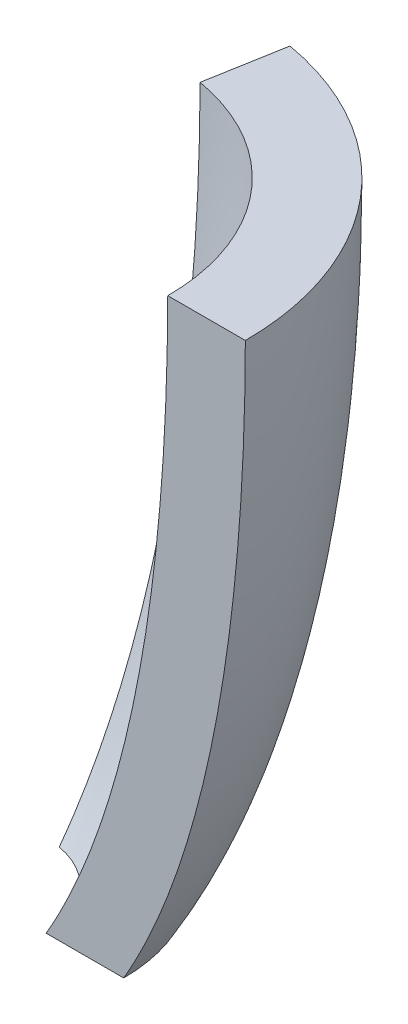
ISO-10303-21;
HEADER;
FILE_DESCRIPTION(('STEP AP214'),'2;1');
FILE_NAME('part.step','',(''),(''),'','','');
FILE_SCHEMA(('AUTOMOTIVE_DESIGN { 1 0 10303 214 1 1 1 1 }'));
ENDSEC;
DATA;
#1=APPLICATION_CONTEXT('core data for automotive mechanical design processes');
#2=APPLICATION_PROTOCOL_DEFINITION('international standard','automotive_design',2000,#1);
#3=PRODUCT_CONTEXT('',#1,'mechanical');
#4=PRODUCT('Part','Part','',(#3));
#5=PRODUCT_RELATED_PRODUCT_CATEGORY('part','',(#4));
#6=PRODUCT_DEFINITION_FORMATION('','',#4);
#7=PRODUCT_DEFINITION_CONTEXT('part definition',#1,'design');
#8=PRODUCT_DEFINITION('design','',#6,#7);
#9=PRODUCT_DEFINITION_SHAPE('','',#8);
#10=(LENGTH_UNIT() NAMED_UNIT(*) SI_UNIT(.MILLI.,.METRE.));
#11=(NAMED_UNIT(*) PLANE_ANGLE_UNIT() SI_UNIT($,.RADIAN.));
#12=(NAMED_UNIT(*) SI_UNIT($,.STERADIAN.) SOLID_ANGLE_UNIT());
#13=UNCERTAINTY_MEASURE_WITH_UNIT(LENGTH_MEASURE(1.E-05),#10,'distance_accuracy_value','');
#14=(GEOMETRIC_REPRESENTATION_CONTEXT(3) GLOBAL_UNCERTAINTY_ASSIGNED_CONTEXT((#13)) GLOBAL_UNIT_ASSIGNED_CONTEXT((#10,
#11,#12)) REPRESENTATION_CONTEXT('',''));
#15=CARTESIAN_POINT('',(0.,0.,0.));
#16=DIRECTION('',(0.,0.,1.));
#17=DIRECTION('',(1.,0.,0.));
#18=AXIS2_PLACEMENT_3D('',#15,#16,#17);
#19=CARTESIAN_POINT('',(6.30342884930946,0.,-35.7485214343432));
#20=CARTESIAN_POINT('',(6.29129475746775,-33.2959656166947,-35.6797055798836));
#21=CARTESIAN_POINT('',(5.40662829135171,-60.9232369629244,-30.6625127341742));
#22=CARTESIAN_POINT('',(3.5810063166775,-79.0124909027462,-20.3088960197096));
#23=B_SPLINE_CURVE_WITH_KNOTS('',3,(#19,#20,#21,#22),.UNSPECIFIED.,.F.,.F.,(4,4),(0.,1.),.UNSPECIFIED.);
#24=CARTESIAN_POINT('',(0.,0.,0.));
#25=DIRECTION('',(0.,-1.,0.));
#26=AXIS1_PLACEMENT('',#24,#25);
#27=SURFACE_OF_REVOLUTION('',#23,#26);
#28=CARTESIAN_POINT('',(0.,0.,0.));
#29=DIRECTION('',(0.,-1.,0.));
#30=DIRECTION('',(1.,0.,0.));
#31=AXIS2_PLACEMENT_3D('',#28,#29,#30);
#32=CIRCLE('',#31,36.3);
#33=CARTESIAN_POINT('',(6.30342884930946,0.,-35.7485214343432));
#34=VERTEX_POINT('',#33);
#35=CARTESIAN_POINT('',(36.3,0.,0.));
#36=VERTEX_POINT('',#35);
#37=EDGE_CURVE('E11',#34,#36,#32,.T.);
#38=ORIENTED_EDGE('',*,*,#37,.T.);
#39=CARTESIAN_POINT('',(36.3,0.,0.));
#40=CARTESIAN_POINT('',(36.2301225500621,-33.2959656166947,0.));
#41=CARTESIAN_POINT('',(31.135531417566,-60.9232369629244,0.));
#42=CARTESIAN_POINT('',(20.6221934764336,-79.0124909027462,0.));
#43=B_SPLINE_CURVE_WITH_KNOTS('',3,(#39,#40,#41,#42),.UNSPECIFIED.,.F.,.F.,(4,4),(0.,1.),.UNSPECIFIED.);
#44=CARTESIAN_POINT('',(20.6221934764336,-79.0124909027461,0.));
#45=VERTEX_POINT('',#44);
#46=EDGE_CURVE('E81',#36,#45,#43,.T.);
#47=ORIENTED_EDGE('',*,*,#46,.T.);
#48=CARTESIAN_POINT('',(0.,-79.0124909027461,0.));
#49=DIRECTION('',(0.,-1.,0.));
#50=DIRECTION('',(1.,0.,0.));
#51=AXIS2_PLACEMENT_3D('',#48,#49,#50);
#52=CIRCLE('',#51,20.6221934764336);
#53=CARTESIAN_POINT('',(3.5810063166775,-79.0124909027461,-20.3088960197096));
#54=VERTEX_POINT('',#53);
#55=EDGE_CURVE('E56',#54,#45,#52,.T.);
#56=ORIENTED_EDGE('',*,*,#55,.F.);
#57=EDGE_CURVE('E83',#34,#54,#23,.T.);
#58=ORIENTED_EDGE('',*,*,#57,.F.);
#59=EDGE_LOOP('',(#38,#47,#56,#58));
#60=FACE_BOUND('',#59,.T.);
#61=ADVANCED_FACE('F41',(#60),#27,.T.);
#62=CARTESIAN_POINT('',(0.,0.,0.));
#63=DIRECTION('',(0.,1.,0.));
#64=DIRECTION('',(-1.,0.,0.));
#65=AXIS2_PLACEMENT_3D('',#62,#63,#64);
#66=PLANE('',#65);
#67=CARTESIAN_POINT('',(0.,0.,0.));
#68=DIRECTION('',(0.,-1.,0.));
#69=DIRECTION('',(1.,0.,0.));
#70=AXIS2_PLACEMENT_3D('',#67,#68,#69);
#71=CIRCLE('',#70,26.3);
#72=CARTESIAN_POINT('',(4.56694707264019,0.,-25.9004439042211));
#73=VERTEX_POINT('',#72);
#74=CARTESIAN_POINT('',(26.3,0.,0.));
#75=VERTEX_POINT('',#74);
#76=EDGE_CURVE('E49',#73,#75,#71,.T.);
#77=ORIENTED_EDGE('',*,*,#76,.T.);
#78=DIRECTION('',(-1.,0.,0.));
#79=VECTOR('',#78,1.);
#80=CARTESIAN_POINT('',(0.,0.,0.));
#81=LINE('',#80,#79);
#82=EDGE_CURVE('E92',#36,#75,#81,.T.);
#83=ORIENTED_EDGE('',*,*,#82,.F.);
#84=ORIENTED_EDGE('',*,*,#37,.F.);
#85=DIRECTION('',(-0.173648177666927,0.,0.984807753012209));
#86=VECTOR('',#85,1.);
#87=CARTESIAN_POINT('',(0.,0.,0.));
#88=LINE('',#87,#86);
#89=EDGE_CURVE('E112',#34,#73,#88,.T.);
#90=ORIENTED_EDGE('',*,*,#89,.T.);
#91=EDGE_LOOP('',(#77,#83,#84,#90));
#92=FACE_BOUND('',#91,.T.);
#93=ADVANCED_FACE('F43',(#92),#66,.T.);
#94=CARTESIAN_POINT('',(4.56694707264019,0.,-25.9004439042211));
#95=CARTESIAN_POINT('',(4.55481298079847,-33.2959656166947,-25.8316280497616));
#96=CARTESIAN_POINT('',(3.67014651468243,-60.9232369629244,-20.8144352040521));
#97=CARTESIAN_POINT('',(1.84452454000822,-79.0124909027462,-10.4608184895875));
#98=B_SPLINE_CURVE_WITH_KNOTS('',3,(#94,#95,#96,#97),.UNSPECIFIED.,.F.,.F.,(4,4),(0.,1.),.UNSPECIFIED.);
#99=CARTESIAN_POINT('',(0.,0.,0.));
#100=DIRECTION('',(0.,-1.,0.));
#101=AXIS1_PLACEMENT('',#99,#100);
#102=SURFACE_OF_REVOLUTION('',#98,#101);
#103=CARTESIAN_POINT('',(0.,-79.0124909027461,0.));
#104=DIRECTION('',(0.,-1.,0.));
#105=DIRECTION('',(1.,0.,0.));
#106=AXIS2_PLACEMENT_3D('',#103,#104,#105);
#107=CIRCLE('',#106,10.6221934764336);
#108=CARTESIAN_POINT('',(1.84452454000823,-79.0124909027461,-10.4608184895875));
#109=VERTEX_POINT('',#108);
#110=CARTESIAN_POINT('',(10.6221934764336,-79.0124909027461,0.));
#111=VERTEX_POINT('',#110);
#112=EDGE_CURVE('E64',#109,#111,#107,.T.);
#113=ORIENTED_EDGE('',*,*,#112,.T.);
#114=CARTESIAN_POINT('',(26.3,0.,0.));
#115=CARTESIAN_POINT('',(26.2301225500621,-33.2959656166947,0.));
#116=CARTESIAN_POINT('',(21.135531417566,-60.9232369629244,0.));
#117=CARTESIAN_POINT('',(10.6221934764336,-79.0124909027462,0.));
#118=B_SPLINE_CURVE_WITH_KNOTS('',3,(#114,#115,#116,#117),.UNSPECIFIED.,.F.,.F.,(4,4),(0.,1.),.UNSPECIFIED.);
#119=EDGE_CURVE('E96',#75,#111,#118,.T.);
#120=ORIENTED_EDGE('',*,*,#119,.F.);
#121=ORIENTED_EDGE('',*,*,#76,.F.);
#122=EDGE_CURVE('E128',#73,#109,#98,.T.);
#123=ORIENTED_EDGE('',*,*,#122,.T.);
#124=EDGE_LOOP('',(#113,#120,#121,#123));
#125=FACE_BOUND('',#124,.T.);
#126=ADVANCED_FACE('F125',(#125),#102,.F.);
#127=CARTESIAN_POINT('',(0.,-79.0124909027461,0.));
#128=DIRECTION('',(0.,1.,0.));
#129=DIRECTION('',(-1.,0.,0.));
#130=AXIS2_PLACEMENT_3D('',#127,#128,#129);
#131=PLANE('',#130);
#132=DIRECTION('',(-0.173648177666927,0.,0.984807753012209));
#133=VECTOR('',#132,1.);
#134=CARTESIAN_POINT('',(0.,-79.0124909027461,0.));
#135=LINE('',#134,#133);
#136=EDGE_CURVE('E133',#54,#109,#135,.T.);
#137=ORIENTED_EDGE('',*,*,#136,.F.);
#138=ORIENTED_EDGE('',*,*,#55,.T.);
#139=DIRECTION('',(-1.,0.,0.));
#140=VECTOR('',#139,1.);
#141=CARTESIAN_POINT('',(0.,-79.0124909027461,0.));
#142=LINE('',#141,#140);
#143=EDGE_CURVE('E94',#45,#111,#142,.T.);
#144=ORIENTED_EDGE('',*,*,#143,.T.);
#145=ORIENTED_EDGE('',*,*,#112,.F.);
#146=EDGE_LOOP('',(#137,#138,#144,#145));
#147=FACE_BOUND('',#146,.T.);
#148=ADVANCED_FACE('F123',(#147),#131,.F.);
#149=CARTESIAN_POINT('',(0.,0.,0.));
#150=DIRECTION('',(0.984807753012209,0.,0.173648177666927));
#151=DIRECTION('',(0.173648177666927,0.,-0.984807753012209));
#152=AXIS2_PLACEMENT_3D('',#149,#150,#151);
#153=PLANE('',#152);
#154=ORIENTED_EDGE('',*,*,#57,.T.);
#155=ORIENTED_EDGE('',*,*,#136,.T.);
#156=ORIENTED_EDGE('',*,*,#122,.F.);
#157=ORIENTED_EDGE('',*,*,#89,.F.);
#158=EDGE_LOOP('',(#154,#155,#156,#157));
#159=FACE_BOUND('',#158,.T.);
#160=ADVANCED_FACE('F121',(#159),#153,.F.);
#161=CARTESIAN_POINT('',(0.,0.,0.));
#162=DIRECTION('',(0.,0.,1.));
#163=DIRECTION('',(1.,0.,0.));
#164=AXIS2_PLACEMENT_3D('',#161,#162,#163);
#165=PLANE('',#164);
#166=ORIENTED_EDGE('',*,*,#46,.F.);
#167=ORIENTED_EDGE('',*,*,#82,.T.);
#168=ORIENTED_EDGE('',*,*,#119,.T.);
#169=ORIENTED_EDGE('',*,*,#143,.F.);
#170=EDGE_LOOP('',(#166,#167,#168,#169));
#171=FACE_BOUND('',#170,.T.);
#172=ADVANCED_FACE('F90',(#171),#165,.T.);
#173=CLOSED_SHELL('',(#61,#93,#126,#148,#160,#172));
#174=MANIFOLD_SOLID_BREP('B2',#173);
#175=ADVANCED_BREP_SHAPE_REPRESENTATION('',(#18,#174),#14);
#176=SHAPE_DEFINITION_REPRESENTATION(#9,#175);
ENDSEC;
END-ISO-10303-21;
